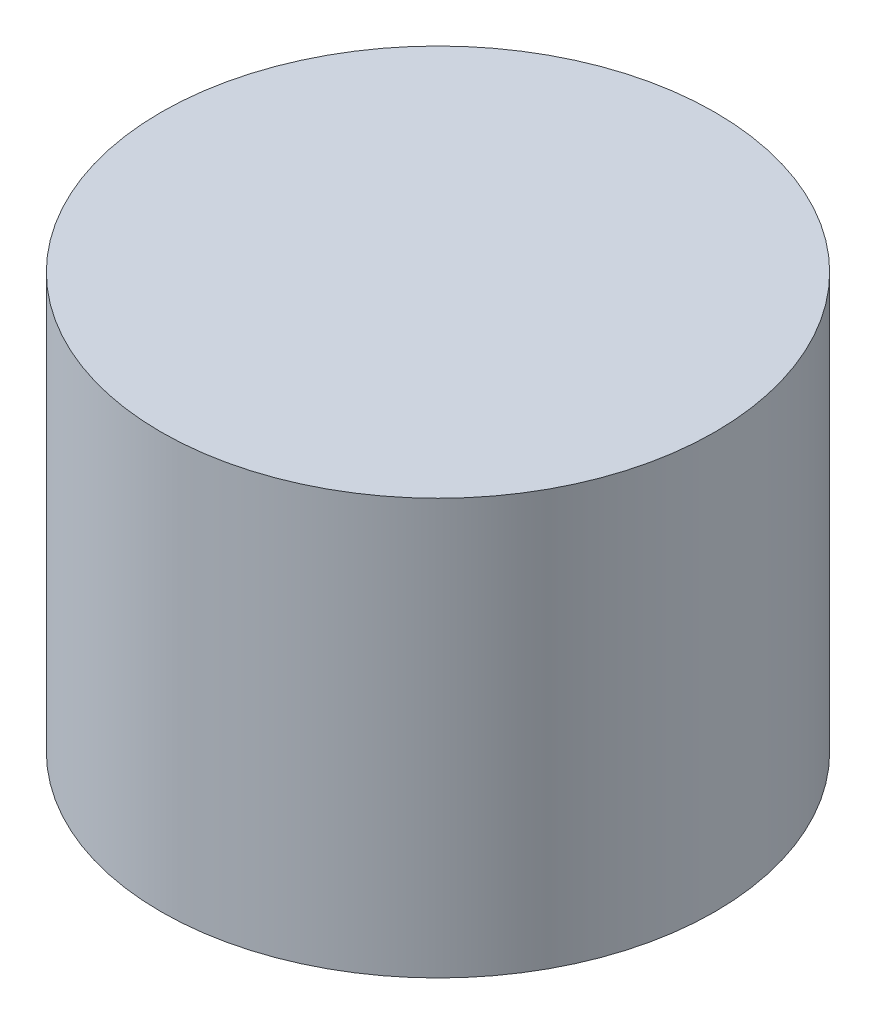
ISO-10303-21;
HEADER;
FILE_DESCRIPTION(('STEP AP214'),'2;1');
FILE_NAME('part.step','',(''),(''),'','','');
FILE_SCHEMA(('AUTOMOTIVE_DESIGN { 1 0 10303 214 1 1 1 1 }'));
ENDSEC;
DATA;
#1=APPLICATION_CONTEXT('core data for automotive mechanical design processes');
#2=APPLICATION_PROTOCOL_DEFINITION('international standard','automotive_design',2000,#1);
#3=PRODUCT_CONTEXT('',#1,'mechanical');
#4=PRODUCT('Part','Part','',(#3));
#5=PRODUCT_RELATED_PRODUCT_CATEGORY('part','',(#4));
#6=PRODUCT_DEFINITION_FORMATION('','',#4);
#7=PRODUCT_DEFINITION_CONTEXT('part definition',#1,'design');
#8=PRODUCT_DEFINITION('design','',#6,#7);
#9=PRODUCT_DEFINITION_SHAPE('','',#8);
#10=(LENGTH_UNIT() NAMED_UNIT(*) SI_UNIT(.MILLI.,.METRE.));
#11=(NAMED_UNIT(*) PLANE_ANGLE_UNIT() SI_UNIT($,.RADIAN.));
#12=(NAMED_UNIT(*) SI_UNIT($,.STERADIAN.) SOLID_ANGLE_UNIT());
#13=UNCERTAINTY_MEASURE_WITH_UNIT(LENGTH_MEASURE(1.E-05),#10,'distance_accuracy_value','');
#14=(GEOMETRIC_REPRESENTATION_CONTEXT(3) GLOBAL_UNCERTAINTY_ASSIGNED_CONTEXT((#13)) GLOBAL_UNIT_ASSIGNED_CONTEXT((#10,
#11,#12)) REPRESENTATION_CONTEXT('',''));
#15=CARTESIAN_POINT('',(0.,0.,0.));
#16=DIRECTION('',(0.,0.,1.));
#17=DIRECTION('',(1.,0.,0.));
#18=AXIS2_PLACEMENT_3D('',#15,#16,#17);
#19=CARTESIAN_POINT('',(0.,6.,0.));
#20=DIRECTION('',(0.,-1.,0.));
#21=DIRECTION('',(0.,0.,-1.));
#22=AXIS2_PLACEMENT_3D('',#19,#20,#21);
#23=CYLINDRICAL_SURFACE('',#22,4.);
#24=CARTESIAN_POINT('',(0.,6.,0.));
#25=DIRECTION('',(0.,1.,0.));
#26=DIRECTION('',(0.,0.,1.));
#27=AXIS2_PLACEMENT_3D('',#24,#25,#26);
#28=CIRCLE('',#27,4.);
#29=CARTESIAN_POINT('',(0.,6.,4.));
#30=VERTEX_POINT('',#29);
#31=EDGE_CURVE('E10',#30,#30,#28,.T.);
#32=ORIENTED_EDGE('',*,*,#31,.F.);
#33=EDGE_LOOP('',(#32));
#34=FACE_BOUND('',#33,.T.);
#35=CARTESIAN_POINT('',(0.,0.,0.));
#36=DIRECTION('',(0.,1.,0.));
#37=DIRECTION('',(0.,0.,1.));
#38=AXIS2_PLACEMENT_3D('',#35,#36,#37);
#39=CIRCLE('',#38,4.);
#40=CARTESIAN_POINT('',(0.,0.,4.));
#41=VERTEX_POINT('',#40);
#42=EDGE_CURVE('E36',#41,#41,#39,.T.);
#43=ORIENTED_EDGE('',*,*,#42,.T.);
#44=EDGE_LOOP('',(#43));
#45=FACE_BOUND('',#44,.T.);
#46=ADVANCED_FACE('F33',(#34,#45),#23,.T.);
#47=CARTESIAN_POINT('',(0.,6.,0.));
#48=DIRECTION('',(0.,1.,0.));
#49=DIRECTION('',(0.,0.,1.));
#50=AXIS2_PLACEMENT_3D('',#47,#48,#49);
#51=PLANE('',#50);
#52=ORIENTED_EDGE('',*,*,#31,.T.);
#53=EDGE_LOOP('',(#52));
#54=FACE_BOUND('',#53,.T.);
#55=ADVANCED_FACE('F48',(#54),#51,.T.);
#56=CARTESIAN_POINT('',(0.,0.,0.));
#57=DIRECTION('',(0.,1.,0.));
#58=DIRECTION('',(0.,0.,1.));
#59=AXIS2_PLACEMENT_3D('',#56,#57,#58);
#60=PLANE('',#59);
#61=ORIENTED_EDGE('',*,*,#42,.F.);
#62=EDGE_LOOP('',(#61));
#63=FACE_BOUND('',#62,.T.);
#64=ADVANCED_FACE('F46',(#63),#60,.F.);
#65=CLOSED_SHELL('',(#46,#55,#64));
#66=MANIFOLD_SOLID_BREP('B2',#65);
#67=ADVANCED_BREP_SHAPE_REPRESENTATION('',(#18,#66),#14);
#68=SHAPE_DEFINITION_REPRESENTATION(#9,#67);
ENDSEC;
END-ISO-10303-21;
